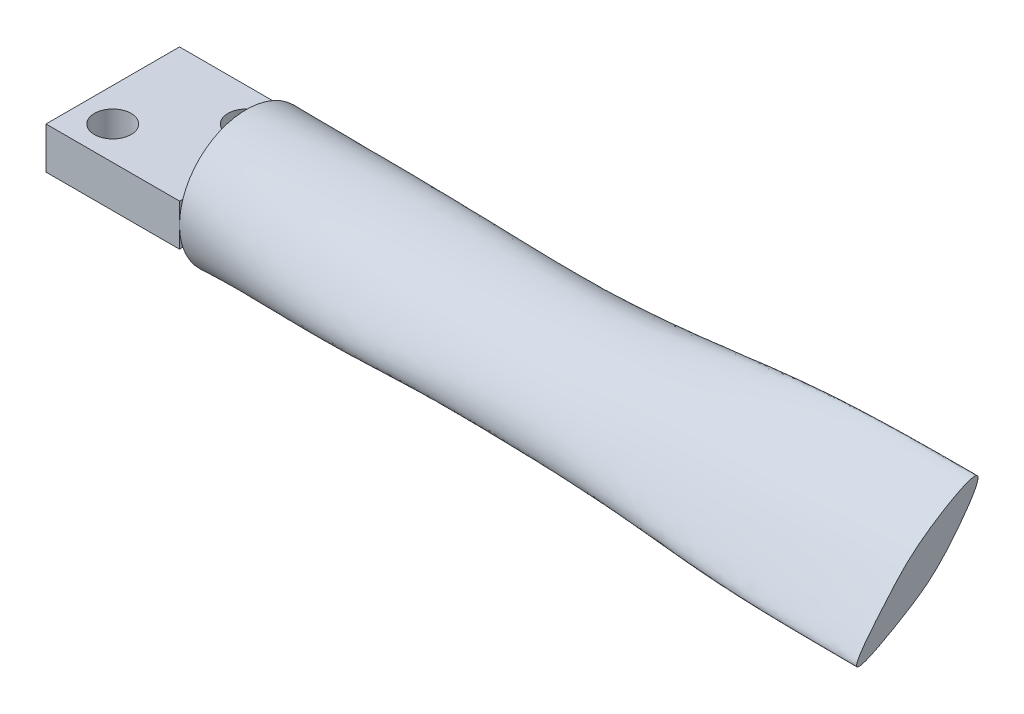
ISO-10303-21;
HEADER;
FILE_DESCRIPTION(('STEP AP214'),'2;1');
FILE_NAME('part.step','',(''),(''),'','','');
FILE_SCHEMA(('AUTOMOTIVE_DESIGN { 1 0 10303 214 1 1 1 1 }'));
ENDSEC;
DATA;
#1=APPLICATION_CONTEXT('core data for automotive mechanical design processes');
#2=APPLICATION_PROTOCOL_DEFINITION('international standard','automotive_design',2000,#1);
#3=PRODUCT_CONTEXT('',#1,'mechanical');
#4=PRODUCT('Part','Part','',(#3));
#5=PRODUCT_RELATED_PRODUCT_CATEGORY('part','',(#4));
#6=PRODUCT_DEFINITION_FORMATION('','',#4);
#7=PRODUCT_DEFINITION_CONTEXT('part definition',#1,'design');
#8=PRODUCT_DEFINITION('design','',#6,#7);
#9=PRODUCT_DEFINITION_SHAPE('','',#8);
#10=(LENGTH_UNIT() NAMED_UNIT(*) SI_UNIT(.MILLI.,.METRE.));
#11=(NAMED_UNIT(*) PLANE_ANGLE_UNIT() SI_UNIT($,.RADIAN.));
#12=(NAMED_UNIT(*) SI_UNIT($,.STERADIAN.) SOLID_ANGLE_UNIT());
#13=UNCERTAINTY_MEASURE_WITH_UNIT(LENGTH_MEASURE(1.E-05),#10,'distance_accuracy_value','');
#14=(GEOMETRIC_REPRESENTATION_CONTEXT(3) GLOBAL_UNCERTAINTY_ASSIGNED_CONTEXT((#13)) GLOBAL_UNIT_ASSIGNED_CONTEXT((#10,
#11,#12)) REPRESENTATION_CONTEXT('',''));
#15=CARTESIAN_POINT('',(0.,0.,0.));
#16=DIRECTION('',(0.,0.,1.));
#17=DIRECTION('',(1.,0.,0.));
#18=AXIS2_PLACEMENT_3D('',#15,#16,#17);
#19=CARTESIAN_POINT('',(0.,0.,0.));
#20=DIRECTION('',(1.,0.,0.));
#21=DIRECTION('',(0.,0.,-1.));
#22=AXIS2_PLACEMENT_3D('',#19,#20,#21);
#23=PLANE('',#22);
#24=DIRECTION('',(0.,0.,-1.));
#25=VECTOR('',#24,1.);
#26=CARTESIAN_POINT('',(0.,1.25,-3.99990439603854));
#27=LINE('',#26,#25);
#28=CARTESIAN_POINT('',(0.,1.24993400537656,3.79974399517644));
#29=VERTEX_POINT('',#28);
#30=CARTESIAN_POINT('',(0.,1.25003440310963,-3.80010453566753));
#31=VERTEX_POINT('',#30);
#32=EDGE_CURVE('E135',#29,#31,#27,.T.);
#33=ORIENTED_EDGE('',*,*,#32,.F.);
#34=CARTESIAN_POINT('',(0.,0.,0.));
#35=DIRECTION('',(1.,0.,0.));
#36=DIRECTION('',(0.,0.,-1.));
#37=AXIS2_PLACEMENT_3D('',#34,#35,#36);
#38=CIRCLE('',#37,4.);
#39=EDGE_CURVE('E213',#31,#29,#38,.T.);
#40=ORIENTED_EDGE('',*,*,#39,.F.);
#41=EDGE_LOOP('',(#33,#40));
#42=FACE_BOUND('',#41,.T.);
#43=ADVANCED_FACE('F123',(#42),#23,.F.);
#44=CARTESIAN_POINT('',(40.,0.757272764463138,0.327745766487539));
#45=DIRECTION('',(-1.,0.,0.));
#46=DIRECTION('',(0.,0.,1.));
#47=AXIS2_PLACEMENT_3D('',#44,#45,#46);
#48=PLANE('',#47);
#49=CARTESIAN_POINT('',(40.,-1.00139709392872,-0.804681116270583));
#50=CARTESIAN_POINT('',(40.,-0.609437192946795,-1.28851112253004));
#51=CARTESIAN_POINT('',(40.,0.548718415604114,-2.43547369048971));
#52=CARTESIAN_POINT('',(40.,4.17263658734926,-5.01863198665266));
#53=CARTESIAN_POINT('',(40.,2.06617839026104,-1.21490983033669));
#54=CARTESIAN_POINT('',(40.,0.655979526919994,0.506932985984334));
#55=CARTESIAN_POINT('',(40.,-0.899277112803795,1.86250179594543));
#56=CARTESIAN_POINT('',(40.,-4.28511246042439,4.70704693097221));
#57=CARTESIAN_POINT('',(40.,-2.17048047763206,0.87611231206344));
#58=CARTESIAN_POINT('',(40.,-1.34892585313099,-0.37569631114398));
#59=CARTESIAN_POINT('',(40.,-1.00139709392872,-0.804681116270583));
#60=B_SPLINE_CURVE_WITH_KNOTS('',3,(#49,#50,#51,#52,#53,#54,#55,#56,#57,#58,#59),.UNSPECIFIED.,
.T.,.F.,(4,1,1,1,1,1,1,1,4),(0.,0.100766534079963,0.257959405371353,0.41272800089722,
0.513321102872844,0.602469459858687,0.755335740698284,0.910655991926233,1.),.UNSPECIFIED.);
#61=CARTESIAN_POINT('',(40.,-1.00139709392872,-0.804681116270583));
#62=VERTEX_POINT('',#61);
#63=EDGE_CURVE('E277',#62,#62,#60,.T.);
#64=ORIENTED_EDGE('',*,*,#63,.T.);
#65=EDGE_LOOP('',(#64));
#66=FACE_BOUND('',#65,.T.);
#67=ADVANCED_FACE('F125',(#66),#48,.F.);
#68=CARTESIAN_POINT('',(0.,-1.25005189081947,3.80015078587725));
#69=VERTEX_POINT('',#68);
#70=CARTESIAN_POINT('',(0.,-1.2499389165771,-3.79975266524782));
#71=VERTEX_POINT('',#70);
#72=EDGE_CURVE('E261',#69,#71,#38,.T.);
#73=ORIENTED_EDGE('',*,*,#72,.F.);
#74=DIRECTION('',(0.,0.,-1.));
#75=VECTOR('',#74,1.);
#76=CARTESIAN_POINT('',(0.,-1.25,-3.99990439603854));
#77=LINE('',#76,#75);
#78=EDGE_CURVE('E12',#69,#71,#77,.T.);
#79=ORIENTED_EDGE('',*,*,#78,.T.);
#80=EDGE_LOOP('',(#73,#79));
#81=FACE_BOUND('',#80,.T.);
#82=ADVANCED_FACE('F313',(#81),#23,.F.);
#83=CARTESIAN_POINT('',(0.,2.1496694510795,-3.37326566565629));
#84=CARTESIAN_POINT('',(3.3311800151065,1.88506638217611,-3.51935165143936));
#85=CARTESIAN_POINT('',(9.99486309324229,1.62227170258652,-3.72720264894459));
#86=CARTESIAN_POINT('',(20.041749357942,1.57952891488636,-3.55568949559229));
#87=CARTESIAN_POINT('',(29.9568924289306,3.24079070557804,-3.59136094141025));
#88=CARTESIAN_POINT('',(36.6572277753544,3.19459507985747,-3.72571988347979));
#89=CARTESIAN_POINT('',(40.,3.07258833207447,-3.82277393621295));
#90=CARTESIAN_POINT('',(0.,2.19621334991285,-3.34360479474569));
#91=CARTESIAN_POINT('',(3.33090948352493,1.91816923264073,-3.50501333332095));
#92=CARTESIAN_POINT('',(9.99497568439133,1.63432226984704,-3.73421150985102));
#93=CARTESIAN_POINT('',(20.0417608897174,1.62031170925477,-3.52986120857131));
#94=CARTESIAN_POINT('',(29.9567321684262,3.24462858158141,-3.57691665753294));
#95=CARTESIAN_POINT('',(36.657591208596,3.20381202304466,-3.71485527157823));
#96=CARTESIAN_POINT('',(40.,3.08574548396719,-3.81539271580971));
#97=CARTESIAN_POINT('',(0.,2.42483195699243,-3.19128025640628));
#98=CARTESIAN_POINT('',(3.32944596815957,2.0805434553619,-3.43074308600033));
#99=CARTESIAN_POINT('',(9.99558812847272,1.69384075905282,-3.76733391484896));
#100=CARTESIAN_POINT('',(20.0418115144575,1.82244672879423,-3.38423519803546));
#101=CARTESIAN_POINT('',(29.9559090438567,3.25512567057423,-3.49858183769383));
#102=CARTESIAN_POINT('',(36.6594635280006,3.24051566101444,-3.6516816924344));
#103=CARTESIAN_POINT('',(40.,3.14274530962637,-3.76870523090437));
#104=CARTESIAN_POINT('',(0.,2.84071301369077,-2.84788658943124));
#105=CARTESIAN_POINT('',(3.32587994978126,2.37983857781335,-3.24925974926436));
#106=CARTESIAN_POINT('',(9.99710456166808,1.80322995329131,-3.80743225299923));
#107=CARTESIAN_POINT('',(20.0418501396971,2.20388695256717,-2.95839191948632));
#108=CARTESIAN_POINT('',(29.9542193396892,3.19306461111445,-3.27746001783867));
#109=CARTESIAN_POINT('',(36.6633500091969,3.22796475479722,-3.44293351382147));
#110=CARTESIAN_POINT('',(40.,3.1724223518752,-3.58225144388406));
#111=CARTESIAN_POINT('',(0.,3.31522832744748,-2.2841881436053));
#112=CARTESIAN_POINT('',(3.32017286654438,2.73161401057872,-2.8844897556103));
#113=CARTESIAN_POINT('',(9.99961528308989,1.93933141297889,-3.70860235340901));
#114=CARTESIAN_POINT('',(20.0416178554105,2.61730488298513,-2.3287322289336));
#115=CARTESIAN_POINT('',(29.9526117602663,2.95426018580357,-2.78858751293556));
#116=CARTESIAN_POINT('',(36.6672247511644,3.03842178472257,-2.96573797886378));
#117=CARTESIAN_POINT('',(40.,3.03712746423299,-3.13438644044014));
#118=CARTESIAN_POINT('',(0.,3.69092197372053,-1.60446546885061));
#119=CARTESIAN_POINT('',(3.31338541766189,3.01995119699207,-2.34318585976566));
#120=CARTESIAN_POINT('',(10.0027193400059,2.05488343939512,-3.34883772084408));
#121=CARTESIAN_POINT('',(20.0409273483742,2.89707986073213,-1.73121607403773));
#122=CARTESIAN_POINT('',(29.9522445122587,2.58395225375473,-2.10699712958231));
#123=CARTESIAN_POINT('',(36.6685296780257,2.69208944251523,-2.30356762135263));
#124=CARTESIAN_POINT('',(40.,2.73469251115233,-2.50313994338763));
#125=CARTESIAN_POINT('',(0.,3.92812281871474,-0.869963435355957));
#126=CARTESIAN_POINT('',(3.30716162933138,3.2060853875087,-1.67319642708889));
#127=CARTESIAN_POINT('',(10.0056620986198,2.12139113323624,-2.76382855370936));
#128=CARTESIAN_POINT('',(20.0399556350362,3.03042340330257,-1.17645403829252));
#129=CARTESIAN_POINT('',(29.953170137875,2.15229512018525,-1.36778145664848));
#130=CARTESIAN_POINT('',(36.6670265828829,2.26554060389035,-1.58768119516493));
#131=CARTESIAN_POINT('',(40.,2.34011215896475,-1.8116778973565));
#132=CARTESIAN_POINT('',(0.,4.02345466734696,-0.105374985142001));
#133=CARTESIAN_POINT('',(3.3026313618705,3.2718289882043,-0.909791213531388));
#134=CARTESIAN_POINT('',(10.0078668924351,2.10697473869247,-2.00834465110901));
#135=CARTESIAN_POINT('',(20.0390280503669,3.03404061201863,-0.623396756932215));
#136=CARTESIAN_POINT('',(29.9546652684655,1.7257942168086,-0.671514313013246));
#137=CARTESIAN_POINT('',(36.6641759409396,1.82808295082313,-0.914747638864808));
#138=CARTESIAN_POINT('',(40.,1.91871715345593,-1.15117588958788));
#139=CARTESIAN_POINT('',(0.,3.96906247997027,0.67153212918361));
#140=CARTESIAN_POINT('',(3.30027124808435,3.20623849339774,-0.0876306772152206));
#141=CARTESIAN_POINT('',(10.0090512806277,2.00024088517495,-1.14204242896375));
#142=CARTESIAN_POINT('',(20.0384193019391,2.91366392092473,-0.0777853325002628));
#143=CARTESIAN_POINT('',(29.9559121745267,1.3380863542679,-0.0759962702273656));
#144=CARTESIAN_POINT('',(36.6616900244926,1.40992127328693,-0.326646482217561));
#145=CARTESIAN_POINT('',(40.,1.49601679579483,-0.552981259446657));
#146=CARTESIAN_POINT('',(0.,3.7655532602938,1.42990370462753));
#147=CARTESIAN_POINT('',(3.30041700653263,2.9874432361018,0.769763093652249));
#148=CARTESIAN_POINT('',(10.0090405444835,1.74742440645935,-0.174143530794719));
#149=CARTESIAN_POINT('',(20.0382378908728,2.71703605842648,0.446323911872295));
#150=CARTESIAN_POINT('',(29.9566517952365,0.952859587297932,0.445535515704107));
#151=CARTESIAN_POINT('',(36.6600971506368,1.01230659607027,0.169735318652852));
#152=CARTESIAN_POINT('',(40.,1.09752038715041,-0.0484413462976938));
#153=CARTESIAN_POINT('',(0.,3.39685381727766,2.16470119526274));
#154=CARTESIAN_POINT('',(3.30296504262711,2.60779685871559,1.61556309311042));
#155=CARTESIAN_POINT('',(10.0079007809079,1.35115183640118,0.795865354394825));
#156=CARTESIAN_POINT('',(20.0384075847845,2.46616688120194,0.94927307449266));
#157=CARTESIAN_POINT('',(29.9571234817392,0.542397819103422,0.912183972719566));
#158=CARTESIAN_POINT('',(36.6588933844017,0.612312430257397,0.603496156709221));
#159=CARTESIAN_POINT('',(40.,0.705245323776495,0.391518709969696));
#160=CARTESIAN_POINT('',(0.,2.88657886650924,2.80927821193685));
#161=CARTESIAN_POINT('',(3.30679546477969,2.13777746923541,2.30140965448664));
#162=CARTESIAN_POINT('',(10.0061736573594,0.939435826987059,1.51857821973038));
#163=CARTESIAN_POINT('',(20.0387108811388,2.15498648322637,1.47728626395088));
#164=CARTESIAN_POINT('',(29.9576528400357,0.0872202483765612,1.33023922934188));
#165=CARTESIAN_POINT('',(36.6574681232896,0.186436653422307,1.00318502273235));
#166=CARTESIAN_POINT('',(40.,0.301209001926901,0.795973769466199));
#167=CARTESIAN_POINT('',(0.,2.28499426203311,3.31396843740524));
#168=CARTESIAN_POINT('',(3.31099550044093,1.57491692685253,2.84615730134542));
#169=CARTESIAN_POINT('',(10.0042971566945,0.434379495056818,2.10929448114406));
#170=CARTESIAN_POINT('',(20.0389828050772,1.82836948215883,1.97247653969183));
#171=CARTESIAN_POINT('',(29.9584593869847,-0.440744419124263,1.74111547514524));
#172=CARTESIAN_POINT('',(36.6554217878424,-0.290694018604555,1.40370152724351));
#173=CARTESIAN_POINT('',(40.,-0.140956970696481,1.19952268472743));
#174=CARTESIAN_POINT('',(0.,1.60403829921052,3.69158945428525));
#175=CARTESIAN_POINT('',(3.31611980978835,0.89721509005483,3.29949948305275));
#176=CARTESIAN_POINT('',(10.0020293509782,-0.233468738196499,2.66779945850481));
#177=CARTESIAN_POINT('',(20.0392386183551,1.5309128505615,2.38504477909492));
#178=CARTESIAN_POINT('',(29.9597266304936,-1.06940525924843,2.18410583322769));
#179=CARTESIAN_POINT('',(36.6523194803119,-0.844645602568922,1.83953010147414));
#180=CARTESIAN_POINT('',(40.,-0.647620986391759,1.63676430828901));
#181=CARTESIAN_POINT('',(0.,0.87019154563078,3.92776637589727));
#182=CARTESIAN_POINT('',(3.32257973770948,0.156184590184093,3.63374088859306));
#183=CARTESIAN_POINT('',(9.99920551856145,-0.980849710863291,3.14968433707692));
#184=CARTESIAN_POINT('',(20.0394380692026,1.25396927761859,2.70822890779541));
#185=CARTESIAN_POINT('',(29.9617829567147,-1.78170607675044,2.65534522232971));
#186=CARTESIAN_POINT('',(36.6474274435447,-1.48593011649628,2.3331313449629));
#187=CARTESIAN_POINT('',(40.,-1.2442024849757,2.14551110087967));
#188=CARTESIAN_POINT('',(0.,0.105252971295643,4.02364537000858));
#189=CARTESIAN_POINT('',(3.32897757194983,-0.590597089166638,3.82523287123889));
#190=CARTESIAN_POINT('',(9.99640411350626,-1.69756538635114,3.4914450765105));
#191=CARTESIAN_POINT('',(20.0396521508653,0.885243532445932,2.99619204230583));
#192=CARTESIAN_POINT('',(29.9637578135213,-2.47396944599114,3.06467399271652));
#193=CARTESIAN_POINT('',(36.6427143862749,-2.14442395964611,2.81410158002323));
#194=CARTESIAN_POINT('',(40.,-1.88241799813704,2.67037480929046));
#195=CARTESIAN_POINT('',(0.,-0.671466867335817,3.96896038993082));
#196=CARTESIAN_POINT('',(3.33331692728894,-1.28498574157291,3.84205125946775));
#197=CARTESIAN_POINT('',(9.99443000115308,-2.26825795220366,3.62627207318453));
#198=CARTESIAN_POINT('',(20.0400571992286,0.345682388702923,3.28214512208348));
#199=CARTESIAN_POINT('',(29.9641283562727,-3.04347482914551,3.32134085256777));
#200=CARTESIAN_POINT('',(36.6415898038165,-2.72851219888302,3.18945429907281));
#201=CARTESIAN_POINT('',(39.9999999999999,-2.4765493332883,3.11827613409965));
#202=CARTESIAN_POINT('',(0.,-1.42993856082801,3.76560795218058));
#203=CARTESIAN_POINT('',(3.33449745541039,-1.86071500216713,3.65446888461476));
#204=CARTESIAN_POINT('',(9.99370499253172,-2.57456832209117,3.4774967886701));
#205=CARTESIAN_POINT('',(20.040826928542,-0.440640174203404,3.59737167553073));
#206=CARTESIAN_POINT('',(29.9617699001237,-3.40310126994841,3.35231387717577));
#207=CARTESIAN_POINT('',(36.6465431188668,-3.16381022494267,3.38453983655491));
#208=CARTESIAN_POINT('',(40.0000000000001,-2.95837183080486,3.41300601008564));
#209=CARTESIAN_POINT('',(0.,-2.04222532587808,3.45828836970072));
#210=CARTESIAN_POINT('',(3.33555508863374,-2.26429347857774,3.35383633313521));
#211=CARTESIAN_POINT('',(9.99298676419904,-2.66556828281793,3.19333952493218));
#212=CARTESIAN_POINT('',(20.0417575849468,-1.12225631062209,3.74757949260544));
#213=CARTESIAN_POINT('',(29.9587581136574,-3.49567756997802,3.14432811213807));
#214=CARTESIAN_POINT('',(36.6529030212556,-3.3488470983015,3.33365325481308));
#215=CARTESIAN_POINT('',(40.,-3.20404312408567,3.4627574518338));
#216=CARTESIAN_POINT('',(0.,-2.48698526937559,3.14170960220576));
#217=CARTESIAN_POINT('',(3.33570360049516,-2.53789126826246,3.05096670703535));
#218=CARTESIAN_POINT('',(9.99275825360545,-2.6780291065467,2.9097766183234));
#219=CARTESIAN_POINT('',(20.0423362340807,-1.58550501505244,3.72562628222841));
#220=CARTESIAN_POINT('',(29.9566648295993,-3.45177119332257,2.84506914731831));
#221=CARTESIAN_POINT('',(36.6573682483603,-3.3686818179864,3.1413782811123));
#222=CARTESIAN_POINT('',(40.,-3.26913540015578,3.34279709177982));
#223=CARTESIAN_POINT('',(0.,-2.8934005107295,2.78632653389828));
#224=CARTESIAN_POINT('',(3.33496669866529,-2.77724284103934,2.71529979400603));
#225=CARTESIAN_POINT('',(9.99296898025086,-2.65979941809884,2.59937488311741));
#226=CARTESIAN_POINT('',(20.0427043842043,-1.97484107977766,3.59159506316156));
#227=CARTESIAN_POINT('',(29.954972670612,-3.3468368229659,2.48181888320558));
#228=CARTESIAN_POINT('',(36.6610434233621,-3.3163903049416,2.86678602619102));
#229=CARTESIAN_POINT('',(40.,-3.25664127062265,3.13036322124945));
#230=CARTESIAN_POINT('',(0.,-3.31396376506162,2.2849854473559));
#231=CARTESIAN_POINT('',(3.33214246278077,-3.00520744146611,2.24457958358747));
#232=CARTESIAN_POINT('',(9.99417230983398,-2.5864010129077,2.16574280531337));
#233=CARTESIAN_POINT('',(20.0427267773778,-2.33189192236197,3.24420527854694));
#234=CARTESIAN_POINT('',(29.953665015484,-3.12334140729904,1.93864895776265));
#235=CARTESIAN_POINT('',(36.6640560930869,-3.13647387411885,2.39821902337534));
#236=CARTESIAN_POINT('',(40.,-3.11438053588727,2.71774711061566));
#237=CARTESIAN_POINT('',(0.,-3.69159103629265,1.60404360050524));
#238=CARTESIAN_POINT('',(3.32597072131869,-3.17405857631954,1.61295766298175));
#239=CARTESIAN_POINT('',(9.99699210478266,-2.42359797531187,1.59541799272633));
#240=CARTESIAN_POINT('',(20.0421083292426,-2.58992933166872,2.63554809317988));
#241=CARTESIAN_POINT('',(29.9532959519803,-2.74767139953764,1.20841424078827));
#242=CARTESIAN_POINT('',(36.6653177728882,-2.7904405598778,1.7105973872033));
#243=CARTESIAN_POINT('',(40.,-2.80057131826695,2.06754025237266));
#244=CARTESIAN_POINT('',(0.,-3.92776724590178,0.87018761869932));
#245=CARTESIAN_POINT('',(3.31821208447852,-3.23422443300722,0.943306420232472));
#246=CARTESIAN_POINT('',(10.0005995699023,-2.20165244668224,1.01282899009063));
#247=CARTESIAN_POINT('',(20.0411110639445,-2.69700429448882,1.88803454419644));
#248=CARTESIAN_POINT('',(29.9536515801587,-2.32857723091514,0.506036607611437));
#249=CARTESIAN_POINT('',(36.6651511320605,-2.38147585044197,0.998291227838036));
#250=CARTESIAN_POINT('',(40.,-2.40992946848969,1.35528474982631));
#251=CARTESIAN_POINT('',(0.,-4.02364169695414,0.105257108340979));
#252=CARTESIAN_POINT('',(3.31032188889125,-3.18730651582788,0.256098983743376));
#253=CARTESIAN_POINT('',(10.0042838449472,-1.92753436963899,0.44204668214657));
#254=CARTESIAN_POINT('',(20.0400420050598,-2.69441266376423,1.11483971071368));
#255=CARTESIAN_POINT('',(29.9542178872045,-1.92481795418139,-0.0767770625794957));
#256=CARTESIAN_POINT('',(36.6645440139221,-1.97465642458323,0.35604558857689));
#257=CARTESIAN_POINT('',(39.9999999999999,-2.00871869033641,0.673999484155693));
#258=CARTESIAN_POINT('',(0.,-3.968968348076,-0.671472883751237));
#259=CARTESIAN_POINT('',(3.30367987249125,-3.0316410043602,-0.433735474548494));
#260=CARTESIAN_POINT('',(10.0073893115907,-1.61159541286933,-0.111402801351025));
#261=CARTESIAN_POINT('',(20.0391279554688,-2.61415960476028,0.393495463412978));
#262=CARTESIAN_POINT('',(29.9547472177218,-1.52748591202515,-0.571114293519843));
#263=CARTESIAN_POINT('',(36.6639204295643,-1.59522333297963,-0.19189543879087));
#264=CARTESIAN_POINT('',(40.,-1.64601543550973,0.0868840647261999));
#265=CARTESIAN_POINT('',(0.,-3.76559249790888,-1.42992823747671));
#266=CARTESIAN_POINT('',(3.29935546670559,-2.77160286149212,-1.10585355972979));
#267=CARTESIAN_POINT('',(10.009429792693,-1.26255889119815,-0.643183203796972));
#268=CARTESIAN_POINT('',(20.038467540289,-2.48488765542346,-0.202428880245333));
#269=CARTESIAN_POINT('',(29.9553353618041,-1.14282943988087,-0.990940337391607));
#270=CARTESIAN_POINT('',(36.662993666881,-1.23554351945427,-0.658319049875825));
#271=CARTESIAN_POINT('',(40.,-1.30511057524005,-0.41695315686972));
#272=CARTESIAN_POINT('',(0.,-3.39685363928513,-2.16470147456899));
#273=CARTESIAN_POINT('',(3.29834247984837,-2.40551205165772,-1.75284457663675));
#274=CARTESIAN_POINT('',(10.0099371867096,-0.898452857106308,-1.14770086472174));
#275=CARTESIAN_POINT('',(20.0382096220897,-2.29614646683773,-0.709583372154863));
#276=CARTESIAN_POINT('',(29.9558580064831,-0.749284249411554,-1.38328061060862));
#277=CARTESIAN_POINT('',(36.6619535040245,-0.868267812018149,-1.08308935013993));
#278=CARTESIAN_POINT('',(40.,-0.957047139154879,-0.869663229110237));
#279=CARTESIAN_POINT('',(0.,-2.88654005670112,-2.80925300777211));
#280=CARTESIAN_POINT('',(3.30085364976422,-1.95217284259526,-2.33656726444648));
#281=CARTESIAN_POINT('',(10.0088119337062,-0.527796512546085,-1.63362713270311));
#282=CARTESIAN_POINT('',(20.0383838090802,-2.04006407629086,-1.16075058137561));
#283=CARTESIAN_POINT('',(29.9562969597524,-0.32455066895722,-1.796261463075));
#284=CARTESIAN_POINT('',(36.6608225614206,-0.466051713653628,-1.50606832693835));
#285=CARTESIAN_POINT('',(40.,-0.572868156881734,-1.30339720047352));
#286=CARTESIAN_POINT('',(0.,-2.28508772165195,-3.31402873777358));
#287=CARTESIAN_POINT('',(3.30615092668461,-1.44398566901448,-2.8271985422351));
#288=CARTESIAN_POINT('',(10.0064028633539,-0.152947397442539,-2.09941491295395));
#289=CARTESIAN_POINT('',(20.038875355394,-1.71521139757565,-1.59270896521662));
#290=CARTESIAN_POINT('',(29.9567601785696,0.155335161803174,-2.20764968491597));
#291=CARTESIAN_POINT('',(36.6594264619337,-0.00276181146283972,-1.93310373110548));
#292=CARTESIAN_POINT('',(40.,-0.126470097063583,-1.74389297883131));
#293=CARTESIAN_POINT('',(0.,-1.60385245785123,-3.69146971288324));
#294=CARTESIAN_POINT('',(3.31315607071466,-0.893741483661996,-3.22618371487952));
#295=CARTESIAN_POINT('',(10.0032351637853,0.217003535860657,-2.53335041271191));
#296=CARTESIAN_POINT('',(20.0394619810512,-1.3260054101544,-2.03091457591228));
#297=CARTESIAN_POINT('',(29.9576091367719,0.744635469612783,-2.65098401843963));
#298=CARTESIAN_POINT('',(36.6570747096166,0.561049894469145,-2.39456321519101));
#299=CARTESIAN_POINT('',(40.,0.408250571656602,-2.21688847205532));
#300=CARTESIAN_POINT('',(0.,-0.870544932756932,-3.9279939890248));
#301=CARTESIAN_POINT('',(3.32027376475226,-0.322580531226057,-3.51426603027656));
#302=CARTESIAN_POINT('',(10.000024920384,0.568325555684551,-2.90455432235319));
#303=CARTESIAN_POINT('',(20.0400287276561,-0.852885814220368,-2.54140091608119));
#304=CARTESIAN_POINT('',(29.9585810040478,1.39435631453371,-3.0658365845286));
#305=CARTESIAN_POINT('',(36.6544514947711,1.19336345229881,-2.85455001214228));
#306=CARTESIAN_POINT('',(40.,1.01254514421764,-2.70455215499915));
#307=CARTESIAN_POINT('',(0.,-0.104587990238379,-4.02321709694182));
#308=CARTESIAN_POINT('',(3.3266663801696,0.254181344607684,-3.68751960492576));
#309=CARTESIAN_POINT('',(9.99714106727978,0.889144412159276,-3.20079763332083));
#310=CARTESIAN_POINT('',(20.040539974486,-0.291561445271494,-3.10171174882673));
#311=CARTESIAN_POINT('',(29.9594455348684,2.05917877597172,-3.41319233896493));
#312=CARTESIAN_POINT('',(36.6521133258818,1.86370529755003,-3.28586324466658));
#313=CARTESIAN_POINT('',(40.,1.66766491555834,-3.18905250251639));
#314=CARTESIAN_POINT('',(0.,0.670210063580697,-3.96976986854055));
#315=CARTESIAN_POINT('',(3.33173551846705,0.824292726677322,-3.7486179732639));
#316=CARTESIAN_POINT('',(9.99482859485513,1.17732429578953,-3.43503790041318));
#317=CARTESIAN_POINT('',(20.0410354551512,0.317750770322952,-3.55259569466512));
#318=CARTESIAN_POINT('',(29.9597951974038,2.65307545391673,-3.65292008080532));
#319=CARTESIAN_POINT('',(36.6509775352805,2.48433671145509,-3.62450076040268));
#320=CARTESIAN_POINT('',(40.,2.2892178548922,-3.5933568169803));
#321=CARTESIAN_POINT('',(0.,1.38157959551393,-3.77774354260237));
#322=CARTESIAN_POINT('',(3.33378400915648,1.33782967732424,-3.70124506845054));
#323=CARTESIAN_POINT('',(9.99382844873602,1.40879057850403,-3.59735766998636));
#324=CARTESIAN_POINT('',(20.0414660665166,0.912789775861146,-3.76293040638788));
#325=CARTESIAN_POINT('',(29.9590774534608,3.05627430967356,-3.72902849594899));
#326=CARTESIAN_POINT('',(36.6523556648008,2.9334176658537,-3.7903320876334));
#327=CARTESIAN_POINT('',(40.,2.75923899299665,-3.82396069517852));
#328=CARTESIAN_POINT('',(0.,1.86849413171526,-3.54581575583474));
#329=CARTESIAN_POINT('',(3.33269234713838,1.68549821050948,-3.60140795192246));
#330=CARTESIAN_POINT('',(9.99423703468412,1.54813153929257,-3.68397503159818));
#331=CARTESIAN_POINT('',(20.0416731331527,1.33367040372528,-3.69413798507063));
#332=CARTESIAN_POINT('',(29.9578321699095,3.20781674602601,-3.67055286496709));
#333=CARTESIAN_POINT('',(36.6551023291018,3.13045636434747,-3.78253243399251));
#334=CARTESIAN_POINT('',(40.,2.98540350849306,-3.85775527448265));
#335=CARTESIAN_POINT('',(0.,2.10312555224615,-3.40292653656689));
#336=CARTESIAN_POINT('',(3.33145054668807,1.85196353171149,-3.53368996955776));
#337=CARTESIAN_POINT('',(9.99475050209323,1.610221135326,-3.72019378803816));
#338=CARTESIAN_POINT('',(20.0417378261666,1.53874612051795,-3.58151778261327));
#339=CARTESIAN_POINT('',(29.957052689435,3.23695282957467,-3.60580522528755));
#340=CARTESIAN_POINT('',(36.6568643421128,3.18537813667028,-3.73658449538135));
#341=CARTESIAN_POINT('',(40.,3.05943118018175,-3.8301551566162));
#342=CARTESIAN_POINT('',(0.,2.1496694510795,-3.37326566565629));
#343=CARTESIAN_POINT('',(3.3311800151065,1.88506638217611,-3.51935165143936));
#344=CARTESIAN_POINT('',(9.99486309324229,1.62227170258652,-3.72720264894459));
#345=CARTESIAN_POINT('',(20.041749357942,1.57952891488636,-3.55568949559229));
#346=CARTESIAN_POINT('',(29.9568924289306,3.24079070557804,-3.59136094141025));
#347=CARTESIAN_POINT('',(36.6572277753544,3.19459507985747,-3.72571988347979));
#348=CARTESIAN_POINT('',(40.,3.07258833207447,-3.82277393621295));
#349=B_SPLINE_SURFACE_WITH_KNOTS('',3,3,((#83,#84,#85,#86,#87,#88,#89),(#90,#91,#92,#93,#94,#95,
#96),(#97,#98,#99,#100,#101,#102,#103),(#104,#105,#106,#107,#108,#109,#110),(#111,#112,#113,
#114,#115,#116,#117),(#118,#119,#120,#121,#122,#123,#124),(#125,#126,#127,#128,#129,#130,#131),
(#132,#133,#134,#135,#136,#137,#138),(#139,#140,#141,#142,#143,#144,#145),(#146,#147,#148,#149,
#150,#151,#152),(#153,#154,#155,#156,#157,#158,#159),(#160,#161,#162,#163,#164,#165,#166),(#167,
#168,#169,#170,#171,#172,#173),(#174,#175,#176,#177,#178,#179,#180),(#181,#182,#183,#184,#185,
#186,#187),(#188,#189,#190,#191,#192,#193,#194),(#195,#196,#197,#198,#199,#200,#201),(#202,#203,
#204,#205,#206,#207,#208),(#209,#210,#211,#212,#213,#214,#215),(#216,#217,#218,#219,#220,#221,
#222),(#223,#224,#225,#226,#227,#228,#229),(#230,#231,#232,#233,#234,#235,#236),(#237,#238,#239,
#240,#241,#242,#243),(#244,#245,#246,#247,#248,#249,#250),(#251,#252,#253,#254,#255,#256,#257),
(#258,#259,#260,#261,#262,#263,#264),(#265,#266,#267,#268,#269,#270,#271),(#272,#273,#274,#275,
#276,#277,#278),(#279,#280,#281,#282,#283,#284,#285),(#286,#287,#288,#289,#290,#291,#292),(#293,
#294,#295,#296,#297,#298,#299),(#300,#301,#302,#303,#304,#305,#306),(#307,#308,#309,#310,#311,
#312,#313),(#314,#315,#316,#317,#318,#319,#320),(#321,#322,#323,#324,#325,#326,#327),(#328,#329,
#330,#331,#332,#333,#334),(#335,#336,#337,#338,#339,#340,#341),(#342,#343,#344,#345,#346,#347,
#348)),.UNSPECIFIED.,.T.,.F.,.F.,(4,1,1,1,1,1,1,1,1,1,1,1,1,1,1,1,1,1,1,1,1,1,1,1,1,1,1,1,1,1,1,
1,1,1,1,4),(4,1,1,1,4),(0.,0.00625000000000009,0.03125,0.0625,0.09375,0.125,0.15625,0.1875,
0.21875,0.25,0.28125,0.3125,0.34375,0.375,0.40625,0.4375,0.46875,0.5,0.515625,0.53125,0.5625,
0.59375,0.625,0.65625,0.6875,0.71875,0.75,0.78125,0.8125,0.84375,0.875,0.90625,0.9375,0.96875,
0.99375,1.),(0.,0.24965658180745,0.499316873593833,0.750487407861038,1.),.UNSPECIFIED.);
#350=CARTESIAN_POINT('',(0.,0.000579157258821461,3.99997049655621));
#351=VERTEX_POINT('',#350);
#352=EDGE_CURVE('E247',#29,#351,#38,.T.);
#353=EDGE_CURVE('E265',#351,#69,#38,.T.);
#354=CARTESIAN_POINT('',(0.,6.20728439734152E-08,-3.99992750930483));
#355=VERTEX_POINT('',#354);
#356=EDGE_CURVE('E128',#71,#355,#38,.T.);
#357=EDGE_CURVE('E209',#355,#31,#38,.T.);
#358=ORIENTED_EDGE('',*,*,#352,.T.);
#359=ORIENTED_EDGE('',*,*,#353,.T.);
#360=ORIENTED_EDGE('',*,*,#72,.T.);
#361=ORIENTED_EDGE('',*,*,#356,.T.);
#362=ORIENTED_EDGE('',*,*,#357,.T.);
#363=ORIENTED_EDGE('',*,*,#39,.T.);
#364=EDGE_LOOP('',(#358,#359,#360,#361,#362,#363));
#365=FACE_BOUND('',#364,.T.);
#366=ORIENTED_EDGE('',*,*,#63,.F.);
#367=EDGE_LOOP('',(#366));
#368=FACE_BOUND('',#367,.T.);
#369=ADVANCED_FACE('F302',(#365,#368),#349,.T.);
#370=CARTESIAN_POINT('',(0.,1.25,-3.99990439603854));
#371=DIRECTION('',(-1.,0.,0.));
#372=DIRECTION('',(0.,0.,1.));
#373=AXIS2_PLACEMENT_3D('',#370,#371,#372);
#374=PLANE('',#373);
#375=CARTESIAN_POINT('',(0.,-1.25,3.99996100789485));
#376=VERTEX_POINT('',#375);
#377=EDGE_CURVE('E229',#376,#69,#77,.T.);
#378=ORIENTED_EDGE('',*,*,#377,.T.);
#379=ORIENTED_EDGE('',*,*,#353,.F.);
#380=DIRECTION('',(0.,-1.,0.));
#381=VECTOR('',#380,1.);
#382=CARTESIAN_POINT('',(0.,1.25,3.99996100789485));
#383=LINE('',#382,#381);
#384=EDGE_CURVE('E364',#351,#376,#383,.T.);
#385=ORIENTED_EDGE('',*,*,#384,.T.);
#386=EDGE_LOOP('',(#378,#379,#385));
#387=FACE_BOUND('',#386,.T.);
#388=ADVANCED_FACE('F312',(#387),#374,.F.);
#389=CARTESIAN_POINT('',(0.,1.25,3.99996100789485));
#390=VERTEX_POINT('',#389);
#391=EDGE_CURVE('E372',#390,#351,#383,.T.);
#392=ORIENTED_EDGE('',*,*,#391,.T.);
#393=ORIENTED_EDGE('',*,*,#352,.F.);
#394=EDGE_CURVE('E195',#390,#29,#27,.T.);
#395=ORIENTED_EDGE('',*,*,#394,.F.);
#396=EDGE_LOOP('',(#392,#393,#395));
#397=FACE_BOUND('',#396,.T.);
#398=ADVANCED_FACE('F333',(#397),#374,.F.);
#399=DIRECTION('',(0.,-1.,0.));
#400=VECTOR('',#399,1.);
#401=CARTESIAN_POINT('',(0.,1.25,-3.99990439603854));
#402=LINE('',#401,#400);
#403=CARTESIAN_POINT('',(0.,-1.25,-3.99990439603854));
#404=VERTEX_POINT('',#403);
#405=EDGE_CURVE('E214',#355,#404,#402,.T.);
#406=ORIENTED_EDGE('',*,*,#405,.F.);
#407=ORIENTED_EDGE('',*,*,#356,.F.);
#408=EDGE_CURVE('E235',#71,#404,#77,.T.);
#409=ORIENTED_EDGE('',*,*,#408,.T.);
#410=EDGE_LOOP('',(#406,#407,#409));
#411=FACE_BOUND('',#410,.T.);
#412=ADVANCED_FACE('F441',(#411),#374,.F.);
#413=CARTESIAN_POINT('',(0.,1.25,-3.99990439603854));
#414=VERTEX_POINT('',#413);
#415=EDGE_CURVE('E185',#31,#414,#27,.T.);
#416=ORIENTED_EDGE('',*,*,#415,.F.);
#417=ORIENTED_EDGE('',*,*,#357,.F.);
#418=EDGE_CURVE('E201',#414,#355,#402,.T.);
#419=ORIENTED_EDGE('',*,*,#418,.F.);
#420=EDGE_LOOP('',(#416,#417,#419));
#421=FACE_BOUND('',#420,.T.);
#422=ADVANCED_FACE('F208',(#421),#374,.F.);
#423=CARTESIAN_POINT('',(0.,1.25,0.));
#424=DIRECTION('',(0.,-1.,0.));
#425=DIRECTION('',(0.,0.,-1.));
#426=AXIS2_PLACEMENT_3D('',#423,#424,#425);
#427=PLANE('',#426);
#428=ORIENTED_EDGE('',*,*,#394,.T.);
#429=ORIENTED_EDGE('',*,*,#32,.T.);
#430=ORIENTED_EDGE('',*,*,#415,.T.);
#431=DIRECTION('',(-1.,0.,0.));
#432=VECTOR('',#431,1.);
#433=CARTESIAN_POINT('',(0.,1.25,-3.99990439603854));
#434=LINE('',#433,#432);
#435=CARTESIAN_POINT('',(-7.99986540393339,1.25,-3.99990439603854));
#436=VERTEX_POINT('',#435);
#437=EDGE_CURVE('E190',#414,#436,#434,.T.);
#438=ORIENTED_EDGE('',*,*,#437,.T.);
#439=DIRECTION('',(0.,0.,1.));
#440=VECTOR('',#439,1.);
#441=CARTESIAN_POINT('',(-7.99986540393339,1.25,-3.99990439603854));
#442=LINE('',#441,#440);
#443=CARTESIAN_POINT('',(-7.99986540393339,1.25,3.99996100789485));
#444=VERTEX_POINT('',#443);
#445=EDGE_CURVE('E206',#436,#444,#442,.T.);
#446=ORIENTED_EDGE('',*,*,#445,.T.);
#447=DIRECTION('',(1.,0.,0.));
#448=VECTOR('',#447,1.);
#449=CARTESIAN_POINT('',(0.,1.25,3.99996100789485));
#450=LINE('',#449,#448);
#451=EDGE_CURVE('E239',#444,#390,#450,.T.);
#452=ORIENTED_EDGE('',*,*,#451,.T.);
#453=EDGE_LOOP('',(#428,#429,#430,#438,#446,#452));
#454=FACE_BOUND('',#453,.T.);
#455=CARTESIAN_POINT('',(-1.99996635098335,1.25,-1.99993804505519));
#456=DIRECTION('',(0.,1.,0.));
#457=DIRECTION('',(0.,0.,1.));
#458=AXIS2_PLACEMENT_3D('',#455,#456,#457);
#459=CIRCLE('',#458,1.09999999934195);
#460=CARTESIAN_POINT('',(-1.99996635098335,1.25,-0.899938045713238));
#461=VERTEX_POINT('',#460);
#462=EDGE_CURVE('E404',#461,#461,#459,.T.);
#463=ORIENTED_EDGE('',*,*,#462,.F.);
#464=EDGE_LOOP('',(#463));
#465=FACE_BOUND('',#464,.T.);
#466=CARTESIAN_POINT('',(-5.99989905295004,1.25,1.9999946569115));
#467=DIRECTION('',(0.,1.,0.));
#468=DIRECTION('',(0.,0.,1.));
#469=AXIS2_PLACEMENT_3D('',#466,#467,#468);
#470=CIRCLE('',#469,1.10000000056078);
#471=CARTESIAN_POINT('',(-5.99989905295004,1.25,3.09999465747229));
#472=VERTEX_POINT('',#471);
#473=EDGE_CURVE('E413',#472,#472,#470,.T.);
#474=ORIENTED_EDGE('',*,*,#473,.F.);
#475=EDGE_LOOP('',(#474));
#476=FACE_BOUND('',#475,.T.);
#477=ADVANCED_FACE('F188',(#454,#465,#476),#427,.F.);
#478=CARTESIAN_POINT('',(0.,-1.25,0.));
#479=DIRECTION('',(0.,-1.,0.));
#480=DIRECTION('',(0.,0.,-1.));
#481=AXIS2_PLACEMENT_3D('',#478,#479,#480);
#482=PLANE('',#481);
#483=CARTESIAN_POINT('',(-1.99996635098335,-1.25,-1.99993804505519));
#484=DIRECTION('',(0.,1.,0.));
#485=DIRECTION('',(0.,0.,1.));
#486=AXIS2_PLACEMENT_3D('',#483,#484,#485);
#487=CIRCLE('',#486,1.09999999934195);
#488=CARTESIAN_POINT('',(-1.99996635098335,-1.25,-0.899938045713238));
#489=VERTEX_POINT('',#488);
#490=EDGE_CURVE('E407',#489,#489,#487,.T.);
#491=ORIENTED_EDGE('',*,*,#490,.T.);
#492=EDGE_LOOP('',(#491));
#493=FACE_BOUND('',#492,.T.);
#494=ORIENTED_EDGE('',*,*,#377,.F.);
#495=DIRECTION('',(1.,0.,0.));
#496=VECTOR('',#495,1.);
#497=CARTESIAN_POINT('',(0.,-1.25,3.99996100789485));
#498=LINE('',#497,#496);
#499=CARTESIAN_POINT('',(-7.99986540393339,-1.25,3.99996100789485));
#500=VERTEX_POINT('',#499);
#501=EDGE_CURVE('E196',#500,#376,#498,.T.);
#502=ORIENTED_EDGE('',*,*,#501,.F.);
#503=DIRECTION('',(0.,0.,1.));
#504=VECTOR('',#503,1.);
#505=CARTESIAN_POINT('',(-7.99986540393339,-1.25,-3.99990439603854));
#506=LINE('',#505,#504);
#507=CARTESIAN_POINT('',(-7.99986540393339,-1.25,-3.99990439603854));
#508=VERTEX_POINT('',#507);
#509=EDGE_CURVE('E388',#508,#500,#506,.T.);
#510=ORIENTED_EDGE('',*,*,#509,.F.);
#511=DIRECTION('',(-1.,0.,0.));
#512=VECTOR('',#511,1.);
#513=CARTESIAN_POINT('',(0.,-1.25,-3.99990439603854));
#514=LINE('',#513,#512);
#515=EDGE_CURVE('E234',#404,#508,#514,.T.);
#516=ORIENTED_EDGE('',*,*,#515,.F.);
#517=ORIENTED_EDGE('',*,*,#408,.F.);
#518=ORIENTED_EDGE('',*,*,#78,.F.);
#519=EDGE_LOOP('',(#494,#502,#510,#516,#517,#518));
#520=FACE_BOUND('',#519,.T.);
#521=CARTESIAN_POINT('',(-5.99989905295004,-1.25,1.9999946569115));
#522=DIRECTION('',(0.,1.,0.));
#523=DIRECTION('',(0.,0.,1.));
#524=AXIS2_PLACEMENT_3D('',#521,#522,#523);
#525=CIRCLE('',#524,1.10000000056078);
#526=CARTESIAN_POINT('',(-5.99989905295004,-1.25,3.09999465747229));
#527=VERTEX_POINT('',#526);
#528=EDGE_CURVE('E416',#527,#527,#525,.T.);
#529=ORIENTED_EDGE('',*,*,#528,.T.);
#530=EDGE_LOOP('',(#529));
#531=FACE_BOUND('',#530,.T.);
#532=ADVANCED_FACE('F400',(#493,#520,#531),#482,.T.);
#533=CARTESIAN_POINT('',(0.,1.25,-3.99990439603854));
#534=DIRECTION('',(0.,0.,1.));
#535=DIRECTION('',(1.,0.,0.));
#536=AXIS2_PLACEMENT_3D('',#533,#534,#535);
#537=PLANE('',#536);
#538=ORIENTED_EDGE('',*,*,#515,.T.);
#539=DIRECTION('',(0.,-1.,0.));
#540=VECTOR('',#539,1.);
#541=CARTESIAN_POINT('',(-7.99986540393339,1.25,-3.99990439603854));
#542=LINE('',#541,#540);
#543=EDGE_CURVE('E203',#436,#508,#542,.T.);
#544=ORIENTED_EDGE('',*,*,#543,.F.);
#545=ORIENTED_EDGE('',*,*,#437,.F.);
#546=ORIENTED_EDGE('',*,*,#418,.T.);
#547=ORIENTED_EDGE('',*,*,#405,.T.);
#548=EDGE_LOOP('',(#538,#544,#545,#546,#547));
#549=FACE_BOUND('',#548,.T.);
#550=ADVANCED_FACE('F200',(#549),#537,.F.);
#551=CARTESIAN_POINT('',(-7.99986540393339,1.25,-3.99990439603854));
#552=DIRECTION('',(1.,0.,0.));
#553=DIRECTION('',(0.,0.,-1.));
#554=AXIS2_PLACEMENT_3D('',#551,#552,#553);
#555=PLANE('',#554);
#556=ORIENTED_EDGE('',*,*,#509,.T.);
#557=DIRECTION('',(0.,-1.,0.));
#558=VECTOR('',#557,1.);
#559=CARTESIAN_POINT('',(-7.99986540393339,1.25,3.99996100789485));
#560=LINE('',#559,#558);
#561=EDGE_CURVE('E380',#444,#500,#560,.T.);
#562=ORIENTED_EDGE('',*,*,#561,.F.);
#563=ORIENTED_EDGE('',*,*,#445,.F.);
#564=ORIENTED_EDGE('',*,*,#543,.T.);
#565=EDGE_LOOP('',(#556,#562,#563,#564));
#566=FACE_BOUND('',#565,.T.);
#567=ADVANCED_FACE('F398',(#566),#555,.F.);
#568=CARTESIAN_POINT('',(0.,1.25,3.99996100789485));
#569=DIRECTION('',(0.,0.,-1.));
#570=DIRECTION('',(-1.,0.,0.));
#571=AXIS2_PLACEMENT_3D('',#568,#569,#570);
#572=PLANE('',#571);
#573=ORIENTED_EDGE('',*,*,#501,.T.);
#574=ORIENTED_EDGE('',*,*,#384,.F.);
#575=ORIENTED_EDGE('',*,*,#391,.F.);
#576=ORIENTED_EDGE('',*,*,#451,.F.);
#577=ORIENTED_EDGE('',*,*,#561,.T.);
#578=EDGE_LOOP('',(#573,#574,#575,#576,#577));
#579=FACE_BOUND('',#578,.T.);
#580=ADVANCED_FACE('F370',(#579),#572,.F.);
#581=CARTESIAN_POINT('',(-1.99996635098335,1.25,-1.99993804505519));
#582=DIRECTION('',(0.,-1.,0.));
#583=DIRECTION('',(0.,0.,-1.));
#584=AXIS2_PLACEMENT_3D('',#581,#582,#583);
#585=CYLINDRICAL_SURFACE('',#584,1.09999999934195);
#586=ORIENTED_EDGE('',*,*,#462,.T.);
#587=EDGE_LOOP('',(#586));
#588=FACE_BOUND('',#587,.T.);
#589=ORIENTED_EDGE('',*,*,#490,.F.);
#590=EDGE_LOOP('',(#589));
#591=FACE_BOUND('',#590,.T.);
#592=ADVANCED_FACE('F511',(#588,#591),#585,.F.);
#593=CARTESIAN_POINT('',(-5.99989905295004,1.25,1.9999946569115));
#594=DIRECTION('',(0.,-1.,0.));
#595=DIRECTION('',(0.,0.,-1.));
#596=AXIS2_PLACEMENT_3D('',#593,#594,#595);
#597=CYLINDRICAL_SURFACE('',#596,1.10000000056078);
#598=ORIENTED_EDGE('',*,*,#473,.T.);
#599=EDGE_LOOP('',(#598));
#600=FACE_BOUND('',#599,.T.);
#601=ORIENTED_EDGE('',*,*,#528,.F.);
#602=EDGE_LOOP('',(#601));
#603=FACE_BOUND('',#602,.T.);
#604=ADVANCED_FACE('F430',(#600,#603),#597,.F.);
#605=CLOSED_SHELL('',(#43,#67,#82,#369,#388,#398,#412,#422,#477,#532,#550,#567,#580,#592,#604));
#606=MANIFOLD_SOLID_BREP('B2',#605);
#607=ADVANCED_BREP_SHAPE_REPRESENTATION('',(#18,#606),#14);
#608=SHAPE_DEFINITION_REPRESENTATION(#9,#607);
ENDSEC;
END-ISO-10303-21;
